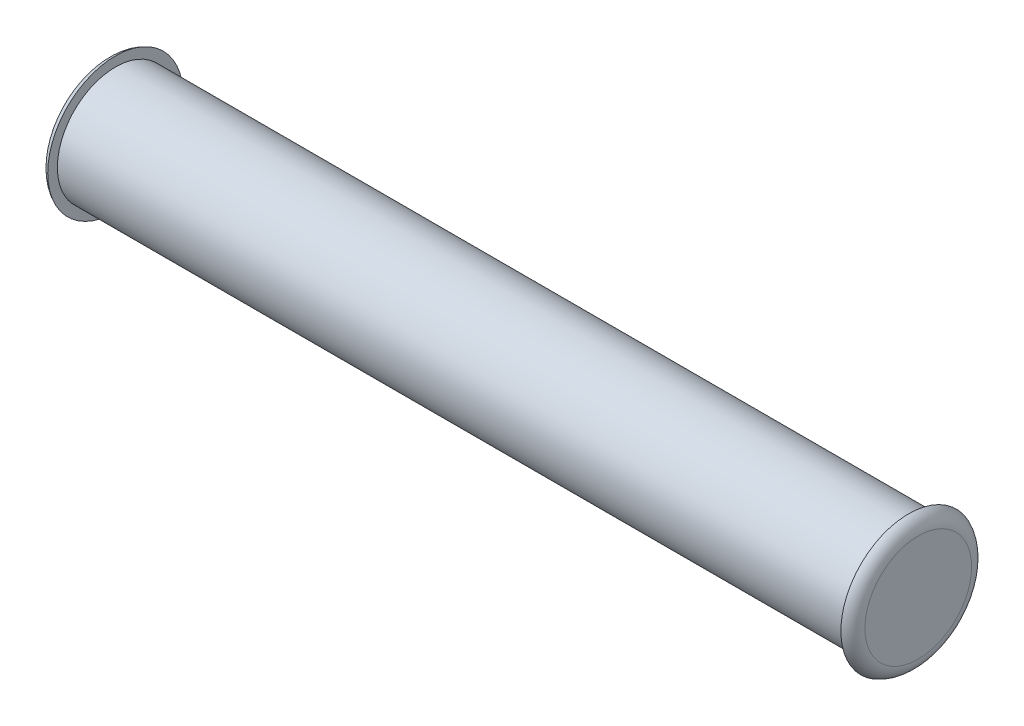
ISO-10303-21;
HEADER;
FILE_DESCRIPTION(('STEP AP214'),'2;1');
FILE_NAME('part.step','',(''),(''),'','','');
FILE_SCHEMA(('AUTOMOTIVE_DESIGN { 1 0 10303 214 1 1 1 1 }'));
ENDSEC;
DATA;
#1=APPLICATION_CONTEXT('core data for automotive mechanical design processes');
#2=APPLICATION_PROTOCOL_DEFINITION('international standard','automotive_design',2000,#1);
#3=PRODUCT_CONTEXT('',#1,'mechanical');
#4=PRODUCT('Part','Part','',(#3));
#5=PRODUCT_RELATED_PRODUCT_CATEGORY('part','',(#4));
#6=PRODUCT_DEFINITION_FORMATION('','',#4);
#7=PRODUCT_DEFINITION_CONTEXT('part definition',#1,'design');
#8=PRODUCT_DEFINITION('design','',#6,#7);
#9=PRODUCT_DEFINITION_SHAPE('','',#8);
#10=(LENGTH_UNIT() NAMED_UNIT(*) SI_UNIT(.MILLI.,.METRE.));
#11=(NAMED_UNIT(*) PLANE_ANGLE_UNIT() SI_UNIT($,.RADIAN.));
#12=(NAMED_UNIT(*) SI_UNIT($,.STERADIAN.) SOLID_ANGLE_UNIT());
#13=UNCERTAINTY_MEASURE_WITH_UNIT(LENGTH_MEASURE(1.E-05),#10,'distance_accuracy_value','');
#14=(GEOMETRIC_REPRESENTATION_CONTEXT(3) GLOBAL_UNCERTAINTY_ASSIGNED_CONTEXT((#13)) GLOBAL_UNIT_ASSIGNED_CONTEXT((#10,
#11,#12)) REPRESENTATION_CONTEXT('',''));
#15=CARTESIAN_POINT('',(0.,0.,0.));
#16=DIRECTION('',(0.,0.,1.));
#17=DIRECTION('',(1.,0.,0.));
#18=AXIS2_PLACEMENT_3D('',#15,#16,#17);
#19=CARTESIAN_POINT('',(10.414,0.,0.));
#20=DIRECTION('',(-1.,0.,0.));
#21=DIRECTION('',(0.,0.,1.));
#22=AXIS2_PLACEMENT_3D('',#19,#20,#21);
#23=CYLINDRICAL_SURFACE('',#22,0.762);
#24=CARTESIAN_POINT('',(10.414,0.,0.));
#25=DIRECTION('',(1.,0.,0.));
#26=DIRECTION('',(0.,0.,-1.));
#27=AXIS2_PLACEMENT_3D('',#24,#25,#26);
#28=CIRCLE('',#27,0.762);
#29=CARTESIAN_POINT('',(10.414,0.,-0.762));
#30=VERTEX_POINT('',#29);
#31=EDGE_CURVE('E41',#30,#30,#28,.T.);
#32=ORIENTED_EDGE('',*,*,#31,.F.);
#33=EDGE_LOOP('',(#32));
#34=FACE_BOUND('',#33,.T.);
#35=CARTESIAN_POINT('',(0.,0.,0.));
#36=DIRECTION('',(-1.,0.,0.));
#37=DIRECTION('',(0.,0.,1.));
#38=AXIS2_PLACEMENT_3D('',#35,#36,#37);
#39=CIRCLE('',#38,0.762);
#40=CARTESIAN_POINT('',(0.,0.,0.762));
#41=VERTEX_POINT('',#40);
#42=EDGE_CURVE('E50',#41,#41,#39,.T.);
#43=ORIENTED_EDGE('',*,*,#42,.F.);
#44=EDGE_LOOP('',(#43));
#45=FACE_BOUND('',#44,.T.);
#46=ADVANCED_FACE('F30',(#34,#45),#23,.T.);
#47=CARTESIAN_POINT('',(10.414,0.,0.));
#48=DIRECTION('',(1.,0.,0.));
#49=DIRECTION('',(0.,0.,-1.));
#50=AXIS2_PLACEMENT_3D('',#47,#48,#49);
#51=PLANE('',#50);
#52=CARTESIAN_POINT('',(10.414,0.,0.));
#53=DIRECTION('',(1.,0.,0.));
#54=DIRECTION('',(0.,0.,-1.));
#55=AXIS2_PLACEMENT_3D('',#52,#53,#54);
#56=CIRCLE('',#55,0.889);
#57=CARTESIAN_POINT('',(10.414,0.,-0.889));
#58=VERTEX_POINT('',#57);
#59=EDGE_CURVE('E45',#58,#58,#56,.T.);
#60=ORIENTED_EDGE('',*,*,#59,.F.);
#61=EDGE_LOOP('',(#60));
#62=FACE_BOUND('',#61,.T.);
#63=ORIENTED_EDGE('',*,*,#31,.T.);
#64=EDGE_LOOP('',(#63));
#65=FACE_BOUND('',#64,.T.);
#66=ADVANCED_FACE('F68',(#62,#65),#51,.F.);
#67=CARTESIAN_POINT('',(10.541,0.,0.));
#68=DIRECTION('',(1.,0.,0.));
#69=DIRECTION('',(0.,0.,-1.));
#70=AXIS2_PLACEMENT_3D('',#67,#68,#69);
#71=PLANE('',#70);
#72=CARTESIAN_POINT('',(10.541,0.,0.));
#73=DIRECTION('',(1.,0.,0.));
#74=DIRECTION('',(0.,0.,-1.));
#75=AXIS2_PLACEMENT_3D('',#72,#73,#74);
#76=CIRCLE('',#75,0.70062855842777);
#77=CARTESIAN_POINT('',(10.541,0.,-0.70062855842777));
#78=VERTEX_POINT('',#77);
#79=EDGE_CURVE('E37',#78,#78,#76,.T.);
#80=ORIENTED_EDGE('',*,*,#79,.T.);
#81=EDGE_LOOP('',(#80));
#82=FACE_BOUND('',#81,.T.);
#83=ADVANCED_FACE('F63',(#82),#71,.T.);
#84=CARTESIAN_POINT('',(0.,0.,0.));
#85=DIRECTION('',(-1.,0.,0.));
#86=DIRECTION('',(0.,0.,1.));
#87=AXIS2_PLACEMENT_3D('',#84,#85,#86);
#88=PLANE('',#87);
#89=CARTESIAN_POINT('',(0.,0.,0.));
#90=DIRECTION('',(-1.,0.,0.));
#91=DIRECTION('',(0.,0.,1.));
#92=AXIS2_PLACEMENT_3D('',#89,#90,#91);
#93=CIRCLE('',#92,0.889);
#94=CARTESIAN_POINT('',(0.,0.,0.889));
#95=VERTEX_POINT('',#94);
#96=EDGE_CURVE('E53',#95,#95,#93,.T.);
#97=ORIENTED_EDGE('',*,*,#96,.F.);
#98=EDGE_LOOP('',(#97));
#99=FACE_BOUND('',#98,.T.);
#100=ORIENTED_EDGE('',*,*,#42,.T.);
#101=EDGE_LOOP('',(#100));
#102=FACE_BOUND('',#101,.T.);
#103=ADVANCED_FACE('F59',(#99,#102),#88,.F.);
#104=CARTESIAN_POINT('',(-0.127,0.,0.));
#105=DIRECTION('',(-1.,0.,0.));
#106=DIRECTION('',(0.,0.,1.));
#107=AXIS2_PLACEMENT_3D('',#104,#105,#106);
#108=PLANE('',#107);
#109=CARTESIAN_POINT('',(-0.127,0.,0.));
#110=DIRECTION('',(-1.,0.,0.));
#111=DIRECTION('',(0.,0.,1.));
#112=AXIS2_PLACEMENT_3D('',#109,#110,#111);
#113=CIRCLE('',#112,0.70062855842777);
#114=CARTESIAN_POINT('',(-0.127,0.,0.70062855842777));
#115=VERTEX_POINT('',#114);
#116=EDGE_CURVE('E10',#115,#115,#113,.T.);
#117=ORIENTED_EDGE('',*,*,#116,.T.);
#118=EDGE_LOOP('',(#117));
#119=FACE_BOUND('',#118,.T.);
#120=ADVANCED_FACE('F62',(#119),#108,.T.);
#121=CARTESIAN_POINT('',(10.3378,0.,0.));
#122=DIRECTION('',(-1.,0.,0.));
#123=DIRECTION('',(0.,0.,1.));
#124=AXIS2_PLACEMENT_3D('',#121,#122,#123);
#125=TOROIDAL_SURFACE('',#124,0.70062855842777,0.2032);
#126=ORIENTED_EDGE('',*,*,#59,.T.);
#127=EDGE_LOOP('',(#126));
#128=FACE_BOUND('',#127,.T.);
#129=ORIENTED_EDGE('',*,*,#79,.F.);
#130=EDGE_LOOP('',(#129));
#131=FACE_BOUND('',#130,.T.);
#132=ADVANCED_FACE('F78',(#128,#131),#125,.T.);
#133=CARTESIAN_POINT('',(0.0762,0.,0.));
#134=DIRECTION('',(1.,0.,0.));
#135=DIRECTION('',(0.,0.,-1.));
#136=AXIS2_PLACEMENT_3D('',#133,#134,#135);
#137=TOROIDAL_SURFACE('',#136,0.70062855842777,0.2032);
#138=ORIENTED_EDGE('',*,*,#96,.T.);
#139=EDGE_LOOP('',(#138));
#140=FACE_BOUND('',#139,.T.);
#141=ORIENTED_EDGE('',*,*,#116,.F.);
#142=EDGE_LOOP('',(#141));
#143=FACE_BOUND('',#142,.T.);
#144=ADVANCED_FACE('F32',(#140,#143),#137,.T.);
#145=CLOSED_SHELL('',(#46,#66,#83,#103,#120,#132,#144));
#146=MANIFOLD_SOLID_BREP('B2',#145);
#147=ADVANCED_BREP_SHAPE_REPRESENTATION('',(#18,#146),#14);
#148=SHAPE_DEFINITION_REPRESENTATION(#9,#147);
ENDSEC;
END-ISO-10303-21;
